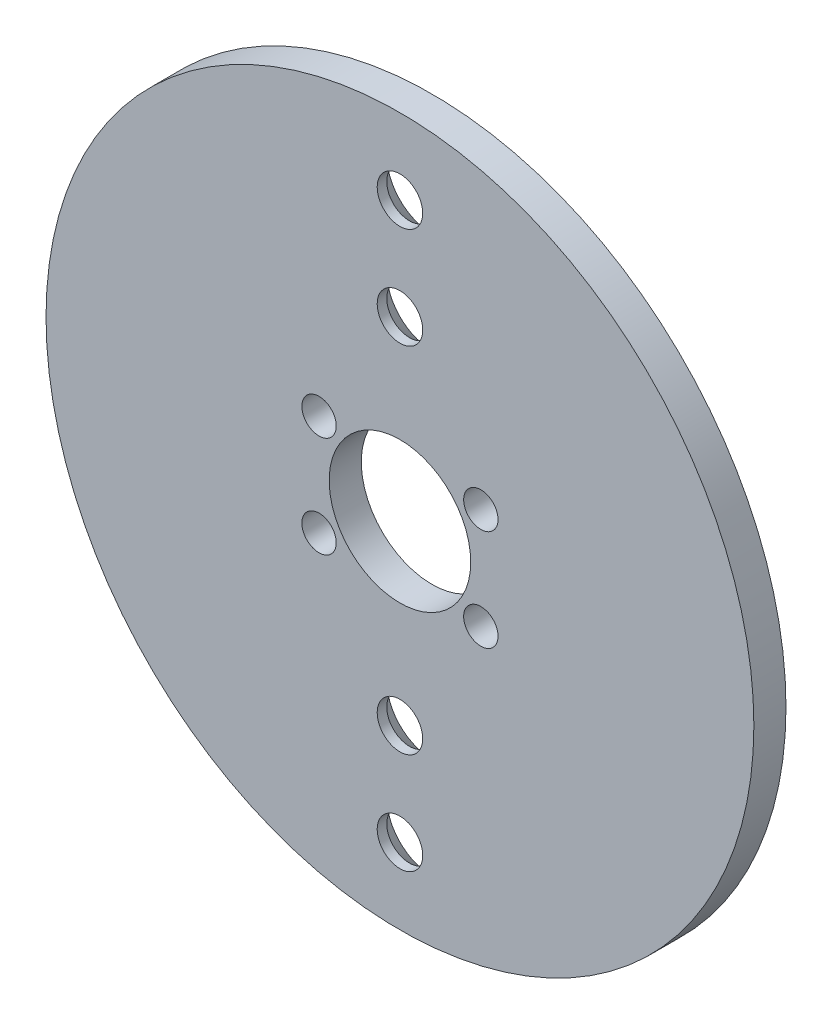
ISO-10303-21;
HEADER;
FILE_DESCRIPTION(('STEP AP214'),'2;1');
FILE_NAME('part.step','',(''),(''),'','','');
FILE_SCHEMA(('AUTOMOTIVE_DESIGN { 1 0 10303 214 1 1 1 1 }'));
ENDSEC;
DATA;
#1=APPLICATION_CONTEXT('core data for automotive mechanical design processes');
#2=APPLICATION_PROTOCOL_DEFINITION('international standard','automotive_design',2000,#1);
#3=PRODUCT_CONTEXT('',#1,'mechanical');
#4=PRODUCT('Part','Part','',(#3));
#5=PRODUCT_RELATED_PRODUCT_CATEGORY('part','',(#4));
#6=PRODUCT_DEFINITION_FORMATION('','',#4);
#7=PRODUCT_DEFINITION_CONTEXT('part definition',#1,'design');
#8=PRODUCT_DEFINITION('design','',#6,#7);
#9=PRODUCT_DEFINITION_SHAPE('','',#8);
#10=(LENGTH_UNIT() NAMED_UNIT(*) SI_UNIT(.MILLI.,.METRE.));
#11=(NAMED_UNIT(*) PLANE_ANGLE_UNIT() SI_UNIT($,.RADIAN.));
#12=(NAMED_UNIT(*) SI_UNIT($,.STERADIAN.) SOLID_ANGLE_UNIT());
#13=UNCERTAINTY_MEASURE_WITH_UNIT(LENGTH_MEASURE(1.E-05),#10,'distance_accuracy_value','');
#14=(GEOMETRIC_REPRESENTATION_CONTEXT(3) GLOBAL_UNCERTAINTY_ASSIGNED_CONTEXT((#13)) GLOBAL_UNIT_ASSIGNED_CONTEXT((#10,
#11,#12)) REPRESENTATION_CONTEXT('',''));
#15=CARTESIAN_POINT('',(0.,0.,0.));
#16=DIRECTION('',(0.,0.,1.));
#17=DIRECTION('',(1.,0.,0.));
#18=AXIS2_PLACEMENT_3D('',#15,#16,#17);
#19=CARTESIAN_POINT('',(0.,0.,1.5875));
#20=DIRECTION('',(0.,0.,-1.));
#21=DIRECTION('',(-1.,0.,0.));
#22=AXIS2_PLACEMENT_3D('',#19,#20,#21);
#23=CYLINDRICAL_SURFACE('',#22,35.);
#24=CARTESIAN_POINT('',(0.,0.,1.5875));
#25=DIRECTION('',(0.,0.,1.));
#26=DIRECTION('',(1.,0.,0.));
#27=AXIS2_PLACEMENT_3D('',#24,#25,#26);
#28=CIRCLE('',#27,35.);
#29=CARTESIAN_POINT('',(35.,0.,1.5875));
#30=VERTEX_POINT('',#29);
#31=EDGE_CURVE('E10',#30,#30,#28,.T.);
#32=ORIENTED_EDGE('',*,*,#31,.F.);
#33=EDGE_LOOP('',(#32));
#34=FACE_BOUND('',#33,.T.);
#35=CARTESIAN_POINT('',(0.,0.,-1.5875));
#36=DIRECTION('',(0.,0.,1.));
#37=DIRECTION('',(1.,0.,0.));
#38=AXIS2_PLACEMENT_3D('',#35,#36,#37);
#39=CIRCLE('',#38,35.);
#40=CARTESIAN_POINT('',(35.,0.,-1.5875));
#41=VERTEX_POINT('',#40);
#42=EDGE_CURVE('E40',#41,#41,#39,.T.);
#43=ORIENTED_EDGE('',*,*,#42,.T.);
#44=EDGE_LOOP('',(#43));
#45=FACE_BOUND('',#44,.T.);
#46=ADVANCED_FACE('F37',(#34,#45),#23,.T.);
#47=CARTESIAN_POINT('',(0.,0.,1.5875));
#48=DIRECTION('',(0.,0.,1.));
#49=DIRECTION('',(1.,0.,0.));
#50=AXIS2_PLACEMENT_3D('',#47,#48,#49);
#51=PLANE('',#50);
#52=CARTESIAN_POINT('',(2.35809573950752E-06,27.5,1.5875));
#53=DIRECTION('',(0.,0.,-1.));
#54=DIRECTION('',(-1.,0.,0.));
#55=AXIS2_PLACEMENT_3D('',#52,#53,#54);
#56=CIRCLE('',#55,2.25);
#57=CARTESIAN_POINT('',(-2.24999764190426,27.5,1.5875));
#58=VERTEX_POINT('',#57);
#59=EDGE_CURVE('E105',#58,#58,#56,.T.);
#60=ORIENTED_EDGE('',*,*,#59,.T.);
#61=EDGE_LOOP('',(#60));
#62=FACE_BOUND('',#61,.T.);
#63=CARTESIAN_POINT('',(2.35809573950752E-06,17.5,1.5875));
#64=DIRECTION('',(0.,0.,-1.));
#65=DIRECTION('',(-1.,0.,0.));
#66=AXIS2_PLACEMENT_3D('',#63,#64,#65);
#67=CIRCLE('',#66,2.25);
#68=CARTESIAN_POINT('',(-2.24999764190426,17.5,1.5875));
#69=VERTEX_POINT('',#68);
#70=EDGE_CURVE('E96',#69,#69,#67,.T.);
#71=ORIENTED_EDGE('',*,*,#70,.T.);
#72=EDGE_LOOP('',(#71));
#73=FACE_BOUND('',#72,.T.);
#74=CARTESIAN_POINT('',(2.35809573950752E-06,-17.5,1.5875));
#75=DIRECTION('',(0.,0.,-1.));
#76=DIRECTION('',(-1.,0.,0.));
#77=AXIS2_PLACEMENT_3D('',#74,#75,#76);
#78=CIRCLE('',#77,2.25);
#79=CARTESIAN_POINT('',(-2.24999764190426,-17.5,1.5875));
#80=VERTEX_POINT('',#79);
#81=EDGE_CURVE('E87',#80,#80,#78,.T.);
#82=ORIENTED_EDGE('',*,*,#81,.T.);
#83=EDGE_LOOP('',(#82));
#84=FACE_BOUND('',#83,.T.);
#85=CARTESIAN_POINT('',(2.35809573950752E-06,-27.5000000000001,1.5875));
#86=DIRECTION('',(0.,0.,-1.));
#87=DIRECTION('',(-1.,0.,0.));
#88=AXIS2_PLACEMENT_3D('',#85,#86,#87);
#89=CIRCLE('',#88,2.25);
#90=CARTESIAN_POINT('',(-2.24999764190426,-27.5000000000001,1.5875));
#91=VERTEX_POINT('',#90);
#92=EDGE_CURVE('E78',#91,#91,#89,.T.);
#93=ORIENTED_EDGE('',*,*,#92,.T.);
#94=EDGE_LOOP('',(#93));
#95=FACE_BOUND('',#94,.T.);
#96=CARTESIAN_POINT('',(8.00000000000283,4.99999999999976,1.5875));
#97=DIRECTION('',(0.,0.,1.));
#98=DIRECTION('',(1.,0.,0.));
#99=AXIS2_PLACEMENT_3D('',#96,#97,#98);
#100=CIRCLE('',#99,1.69999999999999);
#101=CARTESIAN_POINT('',(9.70000000000282,4.99999999999976,1.5875));
#102=VERTEX_POINT('',#101);
#103=EDGE_CURVE('E75',#102,#102,#100,.T.);
#104=ORIENTED_EDGE('',*,*,#103,.F.);
#105=EDGE_LOOP('',(#104));
#106=FACE_BOUND('',#105,.T.);
#107=CARTESIAN_POINT('',(8.00000000000283,-5.00000000000024,1.5875));
#108=DIRECTION('',(0.,0.,1.));
#109=DIRECTION('',(1.,0.,0.));
#110=AXIS2_PLACEMENT_3D('',#107,#108,#109);
#111=CIRCLE('',#110,1.69999999999999);
#112=CARTESIAN_POINT('',(9.70000000000282,-5.00000000000024,1.5875));
#113=VERTEX_POINT('',#112);
#114=EDGE_CURVE('E69',#113,#113,#111,.T.);
#115=ORIENTED_EDGE('',*,*,#114,.F.);
#116=EDGE_LOOP('',(#115));
#117=FACE_BOUND('',#116,.T.);
#118=CARTESIAN_POINT('',(-7.99999999999717,4.99999999999976,1.5875));
#119=DIRECTION('',(0.,0.,1.));
#120=DIRECTION('',(1.,0.,0.));
#121=AXIS2_PLACEMENT_3D('',#118,#119,#120);
#122=CIRCLE('',#121,1.69999999999999);
#123=CARTESIAN_POINT('',(-6.29999999999719,4.99999999999976,1.5875));
#124=VERTEX_POINT('',#123);
#125=EDGE_CURVE('E63',#124,#124,#122,.T.);
#126=ORIENTED_EDGE('',*,*,#125,.F.);
#127=EDGE_LOOP('',(#126));
#128=FACE_BOUND('',#127,.T.);
#129=CARTESIAN_POINT('',(-7.99999999999717,-5.00000000000024,1.5875));
#130=DIRECTION('',(0.,0.,1.));
#131=DIRECTION('',(1.,0.,0.));
#132=AXIS2_PLACEMENT_3D('',#129,#130,#131);
#133=CIRCLE('',#132,1.69999999999999);
#134=CARTESIAN_POINT('',(-6.29999999999718,-5.00000000000024,1.5875));
#135=VERTEX_POINT('',#134);
#136=EDGE_CURVE('E57',#135,#135,#133,.T.);
#137=ORIENTED_EDGE('',*,*,#136,.F.);
#138=EDGE_LOOP('',(#137));
#139=FACE_BOUND('',#138,.T.);
#140=CARTESIAN_POINT('',(0.,0.,1.5875));
#141=DIRECTION('',(0.,0.,1.));
#142=DIRECTION('',(1.,0.,0.));
#143=AXIS2_PLACEMENT_3D('',#140,#141,#142);
#144=CIRCLE('',#143,7.);
#145=CARTESIAN_POINT('',(7.,0.,1.5875));
#146=VERTEX_POINT('',#145);
#147=EDGE_CURVE('E49',#146,#146,#144,.T.);
#148=ORIENTED_EDGE('',*,*,#147,.F.);
#149=EDGE_LOOP('',(#148));
#150=FACE_BOUND('',#149,.T.);
#151=ORIENTED_EDGE('',*,*,#31,.T.);
#152=EDGE_LOOP('',(#151));
#153=FACE_BOUND('',#152,.T.);
#154=ADVANCED_FACE('F121',(#62,#73,#84,#95,#106,#117,#128,#139,#150,#153),#51,.T.);
#155=CARTESIAN_POINT('',(0.,0.,-1.5875));
#156=DIRECTION('',(0.,0.,1.));
#157=DIRECTION('',(1.,0.,0.));
#158=AXIS2_PLACEMENT_3D('',#155,#156,#157);
#159=PLANE('',#158);
#160=CARTESIAN_POINT('',(2.35809573950752E-06,27.5,-1.5875));
#161=DIRECTION('',(0.,0.,-1.));
#162=DIRECTION('',(-1.,0.,0.));
#163=AXIS2_PLACEMENT_3D('',#160,#161,#162);
#164=CIRCLE('',#163,4.48);
#165=CARTESIAN_POINT('',(-4.47999764190426,27.5,-1.5875));
#166=VERTEX_POINT('',#165);
#167=EDGE_CURVE('E111',#166,#166,#164,.T.);
#168=ORIENTED_EDGE('',*,*,#167,.F.);
#169=EDGE_LOOP('',(#168));
#170=FACE_BOUND('',#169,.T.);
#171=CARTESIAN_POINT('',(2.35809573950752E-06,17.5,-1.5875));
#172=DIRECTION('',(0.,0.,-1.));
#173=DIRECTION('',(-1.,0.,0.));
#174=AXIS2_PLACEMENT_3D('',#171,#172,#173);
#175=CIRCLE('',#174,4.48);
#176=CARTESIAN_POINT('',(-4.47999764190426,17.5,-1.5875));
#177=VERTEX_POINT('',#176);
#178=EDGE_CURVE('E102',#177,#177,#175,.T.);
#179=ORIENTED_EDGE('',*,*,#178,.F.);
#180=EDGE_LOOP('',(#179));
#181=FACE_BOUND('',#180,.T.);
#182=CARTESIAN_POINT('',(2.35809573950752E-06,-17.5,-1.5875));
#183=DIRECTION('',(0.,0.,-1.));
#184=DIRECTION('',(-1.,0.,0.));
#185=AXIS2_PLACEMENT_3D('',#182,#183,#184);
#186=CIRCLE('',#185,4.48);
#187=CARTESIAN_POINT('',(-4.47999764190426,-17.5,-1.5875));
#188=VERTEX_POINT('',#187);
#189=EDGE_CURVE('E93',#188,#188,#186,.T.);
#190=ORIENTED_EDGE('',*,*,#189,.F.);
#191=EDGE_LOOP('',(#190));
#192=FACE_BOUND('',#191,.T.);
#193=CARTESIAN_POINT('',(2.35809573950752E-06,-27.5000000000001,-1.5875));
#194=DIRECTION('',(0.,0.,-1.));
#195=DIRECTION('',(-1.,0.,0.));
#196=AXIS2_PLACEMENT_3D('',#193,#194,#195);
#197=CIRCLE('',#196,4.48);
#198=CARTESIAN_POINT('',(-4.47999764190426,-27.5000000000001,-1.5875));
#199=VERTEX_POINT('',#198);
#200=EDGE_CURVE('E84',#199,#199,#197,.T.);
#201=ORIENTED_EDGE('',*,*,#200,.F.);
#202=EDGE_LOOP('',(#201));
#203=FACE_BOUND('',#202,.T.);
#204=CARTESIAN_POINT('',(8.00000000000283,4.99999999999976,-1.5875));
#205=DIRECTION('',(0.,0.,1.));
#206=DIRECTION('',(1.,0.,0.));
#207=AXIS2_PLACEMENT_3D('',#204,#205,#206);
#208=CIRCLE('',#207,1.7);
#209=CARTESIAN_POINT('',(9.70000000000283,4.99999999999976,-1.5875));
#210=VERTEX_POINT('',#209);
#211=EDGE_CURVE('E72',#210,#210,#208,.T.);
#212=ORIENTED_EDGE('',*,*,#211,.T.);
#213=EDGE_LOOP('',(#212));
#214=FACE_BOUND('',#213,.T.);
#215=CARTESIAN_POINT('',(8.00000000000283,-5.00000000000024,-1.5875));
#216=DIRECTION('',(0.,0.,1.));
#217=DIRECTION('',(1.,0.,0.));
#218=AXIS2_PLACEMENT_3D('',#215,#216,#217);
#219=CIRCLE('',#218,1.7);
#220=CARTESIAN_POINT('',(9.70000000000283,-5.00000000000024,-1.5875));
#221=VERTEX_POINT('',#220);
#222=EDGE_CURVE('E66',#221,#221,#219,.T.);
#223=ORIENTED_EDGE('',*,*,#222,.T.);
#224=EDGE_LOOP('',(#223));
#225=FACE_BOUND('',#224,.T.);
#226=CARTESIAN_POINT('',(-7.99999999999717,4.99999999999976,-1.5875));
#227=DIRECTION('',(0.,0.,1.));
#228=DIRECTION('',(1.,0.,0.));
#229=AXIS2_PLACEMENT_3D('',#226,#227,#228);
#230=CIRCLE('',#229,1.7);
#231=CARTESIAN_POINT('',(-6.29999999999718,4.99999999999976,-1.5875));
#232=VERTEX_POINT('',#231);
#233=EDGE_CURVE('E60',#232,#232,#230,.T.);
#234=ORIENTED_EDGE('',*,*,#233,.T.);
#235=EDGE_LOOP('',(#234));
#236=FACE_BOUND('',#235,.T.);
#237=CARTESIAN_POINT('',(-7.99999999999717,-5.00000000000024,-1.5875));
#238=DIRECTION('',(0.,0.,1.));
#239=DIRECTION('',(1.,0.,0.));
#240=AXIS2_PLACEMENT_3D('',#237,#238,#239);
#241=CIRCLE('',#240,1.7);
#242=CARTESIAN_POINT('',(-6.29999999999717,-5.00000000000024,-1.5875));
#243=VERTEX_POINT('',#242);
#244=EDGE_CURVE('E52',#243,#243,#241,.T.);
#245=ORIENTED_EDGE('',*,*,#244,.T.);
#246=EDGE_LOOP('',(#245));
#247=FACE_BOUND('',#246,.T.);
#248=CARTESIAN_POINT('',(0.,0.,-1.5875));
#249=DIRECTION('',(0.,0.,1.));
#250=DIRECTION('',(1.,0.,0.));
#251=AXIS2_PLACEMENT_3D('',#248,#249,#250);
#252=CIRCLE('',#251,7.);
#253=CARTESIAN_POINT('',(7.,0.,-1.5875));
#254=VERTEX_POINT('',#253);
#255=EDGE_CURVE('E47',#254,#254,#252,.T.);
#256=ORIENTED_EDGE('',*,*,#255,.T.);
#257=EDGE_LOOP('',(#256));
#258=FACE_BOUND('',#257,.T.);
#259=ORIENTED_EDGE('',*,*,#42,.F.);
#260=EDGE_LOOP('',(#259));
#261=FACE_BOUND('',#260,.T.);
#262=ADVANCED_FACE('F117',(#170,#181,#192,#203,#214,#225,#236,#247,#258,#261),#159,.F.);
#263=CARTESIAN_POINT('',(0.,0.,-1.5875));
#264=DIRECTION('',(0.,0.,1.));
#265=DIRECTION('',(1.,0.,0.));
#266=AXIS2_PLACEMENT_3D('',#263,#264,#265);
#267=CYLINDRICAL_SURFACE('',#266,7.);
#268=ORIENTED_EDGE('',*,*,#255,.F.);
#269=EDGE_LOOP('',(#268));
#270=FACE_BOUND('',#269,.T.);
#271=ORIENTED_EDGE('',*,*,#147,.T.);
#272=EDGE_LOOP('',(#271));
#273=FACE_BOUND('',#272,.T.);
#274=ADVANCED_FACE('F120',(#270,#273),#267,.F.);
#275=CARTESIAN_POINT('',(-7.99999999999717,-5.00000000000024,1.5875));
#276=DIRECTION('',(0.,0.,1.));
#277=DIRECTION('',(1.,0.,0.));
#278=AXIS2_PLACEMENT_3D('',#275,#276,#277);
#279=CYLINDRICAL_SURFACE('',#278,1.69999999999999);
#280=ORIENTED_EDGE('',*,*,#244,.F.);
#281=EDGE_LOOP('',(#280));
#282=FACE_BOUND('',#281,.T.);
#283=ORIENTED_EDGE('',*,*,#136,.T.);
#284=EDGE_LOOP('',(#283));
#285=FACE_BOUND('',#284,.T.);
#286=ADVANCED_FACE('F154',(#282,#285),#279,.F.);
#287=CARTESIAN_POINT('',(-7.99999999999717,4.99999999999976,1.5875));
#288=DIRECTION('',(0.,0.,1.));
#289=DIRECTION('',(1.,0.,0.));
#290=AXIS2_PLACEMENT_3D('',#287,#288,#289);
#291=CYLINDRICAL_SURFACE('',#290,1.69999999999999);
#292=ORIENTED_EDGE('',*,*,#233,.F.);
#293=EDGE_LOOP('',(#292));
#294=FACE_BOUND('',#293,.T.);
#295=ORIENTED_EDGE('',*,*,#125,.T.);
#296=EDGE_LOOP('',(#295));
#297=FACE_BOUND('',#296,.T.);
#298=ADVANCED_FACE('F158',(#294,#297),#291,.F.);
#299=CARTESIAN_POINT('',(8.00000000000283,-5.00000000000024,1.5875));
#300=DIRECTION('',(0.,0.,1.));
#301=DIRECTION('',(1.,0.,0.));
#302=AXIS2_PLACEMENT_3D('',#299,#300,#301);
#303=CYLINDRICAL_SURFACE('',#302,1.69999999999999);
#304=ORIENTED_EDGE('',*,*,#222,.F.);
#305=EDGE_LOOP('',(#304));
#306=FACE_BOUND('',#305,.T.);
#307=ORIENTED_EDGE('',*,*,#114,.T.);
#308=EDGE_LOOP('',(#307));
#309=FACE_BOUND('',#308,.T.);
#310=ADVANCED_FACE('F162',(#306,#309),#303,.F.);
#311=CARTESIAN_POINT('',(8.00000000000283,4.99999999999976,1.5875));
#312=DIRECTION('',(0.,0.,1.));
#313=DIRECTION('',(1.,0.,0.));
#314=AXIS2_PLACEMENT_3D('',#311,#312,#313);
#315=CYLINDRICAL_SURFACE('',#314,1.69999999999999);
#316=ORIENTED_EDGE('',*,*,#211,.F.);
#317=EDGE_LOOP('',(#316));
#318=FACE_BOUND('',#317,.T.);
#319=ORIENTED_EDGE('',*,*,#103,.T.);
#320=EDGE_LOOP('',(#319));
#321=FACE_BOUND('',#320,.T.);
#322=ADVANCED_FACE('F166',(#318,#321),#315,.F.);
#323=CARTESIAN_POINT('',(2.35809573950752E-06,-27.5000000000001,-1.5875));
#324=DIRECTION('',(0.,0.,-1.));
#325=DIRECTION('',(-1.,0.,0.));
#326=AXIS2_PLACEMENT_3D('',#323,#324,#325);
#327=CYLINDRICAL_SURFACE('',#326,2.25);
#328=ORIENTED_EDGE('',*,*,#92,.F.);
#329=EDGE_LOOP('',(#328));
#330=FACE_BOUND('',#329,.T.);
#331=CARTESIAN_POINT('',(2.35809573950752E-06,-27.5000000000001,0.642499999999999));
#332=DIRECTION('',(0.,0.,-1.));
#333=DIRECTION('',(-1.,0.,0.));
#334=AXIS2_PLACEMENT_3D('',#331,#332,#333);
#335=CIRCLE('',#334,2.25);
#336=CARTESIAN_POINT('',(-2.24999764190426,-27.5000000000001,0.642499999999999));
#337=VERTEX_POINT('',#336);
#338=EDGE_CURVE('E81',#337,#337,#335,.T.);
#339=ORIENTED_EDGE('',*,*,#338,.T.);
#340=EDGE_LOOP('',(#339));
#341=FACE_BOUND('',#340,.T.);
#342=ADVANCED_FACE('F169',(#330,#341),#327,.F.);
#343=CARTESIAN_POINT('',(2.35809573950752E-06,-27.5000000000001,-1.5875));
#344=DIRECTION('',(0.,0.,-1.));
#345=DIRECTION('',(-1.,0.,0.));
#346=AXIS2_PLACEMENT_3D('',#343,#344,#345);
#347=CONICAL_SURFACE('',#346,4.48,0.785398163397449);
#348=ORIENTED_EDGE('',*,*,#338,.F.);
#349=EDGE_LOOP('',(#348));
#350=FACE_BOUND('',#349,.T.);
#351=ORIENTED_EDGE('',*,*,#200,.T.);
#352=EDGE_LOOP('',(#351));
#353=FACE_BOUND('',#352,.T.);
#354=ADVANCED_FACE('F173',(#350,#353),#347,.F.);
#355=CARTESIAN_POINT('',(2.35809573950752E-06,-17.5,-1.5875));
#356=DIRECTION('',(0.,0.,-1.));
#357=DIRECTION('',(-1.,0.,0.));
#358=AXIS2_PLACEMENT_3D('',#355,#356,#357);
#359=CYLINDRICAL_SURFACE('',#358,2.25);
#360=ORIENTED_EDGE('',*,*,#81,.F.);
#361=EDGE_LOOP('',(#360));
#362=FACE_BOUND('',#361,.T.);
#363=CARTESIAN_POINT('',(2.35809573950752E-06,-17.5,0.642499999999999));
#364=DIRECTION('',(0.,0.,-1.));
#365=DIRECTION('',(-1.,0.,0.));
#366=AXIS2_PLACEMENT_3D('',#363,#364,#365);
#367=CIRCLE('',#366,2.25);
#368=CARTESIAN_POINT('',(-2.24999764190426,-17.5,0.642499999999999));
#369=VERTEX_POINT('',#368);
#370=EDGE_CURVE('E90',#369,#369,#367,.T.);
#371=ORIENTED_EDGE('',*,*,#370,.T.);
#372=EDGE_LOOP('',(#371));
#373=FACE_BOUND('',#372,.T.);
#374=ADVANCED_FACE('F177',(#362,#373),#359,.F.);
#375=CARTESIAN_POINT('',(2.35809573950752E-06,-17.5,-1.5875));
#376=DIRECTION('',(0.,0.,-1.));
#377=DIRECTION('',(-1.,0.,0.));
#378=AXIS2_PLACEMENT_3D('',#375,#376,#377);
#379=CONICAL_SURFACE('',#378,4.48,0.785398163397449);
#380=ORIENTED_EDGE('',*,*,#370,.F.);
#381=EDGE_LOOP('',(#380));
#382=FACE_BOUND('',#381,.T.);
#383=ORIENTED_EDGE('',*,*,#189,.T.);
#384=EDGE_LOOP('',(#383));
#385=FACE_BOUND('',#384,.T.);
#386=ADVANCED_FACE('F181',(#382,#385),#379,.F.);
#387=CARTESIAN_POINT('',(2.35809573950752E-06,17.5,-1.5875));
#388=DIRECTION('',(0.,0.,-1.));
#389=DIRECTION('',(-1.,0.,0.));
#390=AXIS2_PLACEMENT_3D('',#387,#388,#389);
#391=CYLINDRICAL_SURFACE('',#390,2.25);
#392=ORIENTED_EDGE('',*,*,#70,.F.);
#393=EDGE_LOOP('',(#392));
#394=FACE_BOUND('',#393,.T.);
#395=CARTESIAN_POINT('',(2.35809573950752E-06,17.5,0.642499999999999));
#396=DIRECTION('',(0.,0.,-1.));
#397=DIRECTION('',(-1.,0.,0.));
#398=AXIS2_PLACEMENT_3D('',#395,#396,#397);
#399=CIRCLE('',#398,2.25);
#400=CARTESIAN_POINT('',(-2.24999764190426,17.5,0.642499999999999));
#401=VERTEX_POINT('',#400);
#402=EDGE_CURVE('E99',#401,#401,#399,.T.);
#403=ORIENTED_EDGE('',*,*,#402,.T.);
#404=EDGE_LOOP('',(#403));
#405=FACE_BOUND('',#404,.T.);
#406=ADVANCED_FACE('F185',(#394,#405),#391,.F.);
#407=CARTESIAN_POINT('',(2.35809573950752E-06,17.5,-1.5875));
#408=DIRECTION('',(0.,0.,-1.));
#409=DIRECTION('',(-1.,0.,0.));
#410=AXIS2_PLACEMENT_3D('',#407,#408,#409);
#411=CONICAL_SURFACE('',#410,4.48,0.785398163397449);
#412=ORIENTED_EDGE('',*,*,#402,.F.);
#413=EDGE_LOOP('',(#412));
#414=FACE_BOUND('',#413,.T.);
#415=ORIENTED_EDGE('',*,*,#178,.T.);
#416=EDGE_LOOP('',(#415));
#417=FACE_BOUND('',#416,.T.);
#418=ADVANCED_FACE('F189',(#414,#417),#411,.F.);
#419=CARTESIAN_POINT('',(2.35809573950752E-06,27.5,-1.5875));
#420=DIRECTION('',(0.,0.,-1.));
#421=DIRECTION('',(-1.,0.,0.));
#422=AXIS2_PLACEMENT_3D('',#419,#420,#421);
#423=CYLINDRICAL_SURFACE('',#422,2.25);
#424=ORIENTED_EDGE('',*,*,#59,.F.);
#425=EDGE_LOOP('',(#424));
#426=FACE_BOUND('',#425,.T.);
#427=CARTESIAN_POINT('',(2.35809573950752E-06,27.5,0.642499999999999));
#428=DIRECTION('',(0.,0.,-1.));
#429=DIRECTION('',(-1.,0.,0.));
#430=AXIS2_PLACEMENT_3D('',#427,#428,#429);
#431=CIRCLE('',#430,2.25);
#432=CARTESIAN_POINT('',(-2.24999764190426,27.5,0.642499999999999));
#433=VERTEX_POINT('',#432);
#434=EDGE_CURVE('E108',#433,#433,#431,.T.);
#435=ORIENTED_EDGE('',*,*,#434,.T.);
#436=EDGE_LOOP('',(#435));
#437=FACE_BOUND('',#436,.T.);
#438=ADVANCED_FACE('F193',(#426,#437),#423,.F.);
#439=CARTESIAN_POINT('',(2.35809573950752E-06,27.5,-1.5875));
#440=DIRECTION('',(0.,0.,-1.));
#441=DIRECTION('',(-1.,0.,0.));
#442=AXIS2_PLACEMENT_3D('',#439,#440,#441);
#443=CONICAL_SURFACE('',#442,4.48,0.785398163397449);
#444=ORIENTED_EDGE('',*,*,#434,.F.);
#445=EDGE_LOOP('',(#444));
#446=FACE_BOUND('',#445,.T.);
#447=ORIENTED_EDGE('',*,*,#167,.T.);
#448=EDGE_LOOP('',(#447));
#449=FACE_BOUND('',#448,.T.);
#450=ADVANCED_FACE('F115',(#446,#449),#443,.F.);
#451=CLOSED_SHELL('',(#46,#154,#262,#274,#286,#298,#310,#322,#342,#354,#374,#386,#406,#418,#438,#450));
#452=MANIFOLD_SOLID_BREP('B2',#451);
#453=ADVANCED_BREP_SHAPE_REPRESENTATION('',(#18,#452),#14);
#454=SHAPE_DEFINITION_REPRESENTATION(#9,#453);
ENDSEC;
END-ISO-10303-21;
